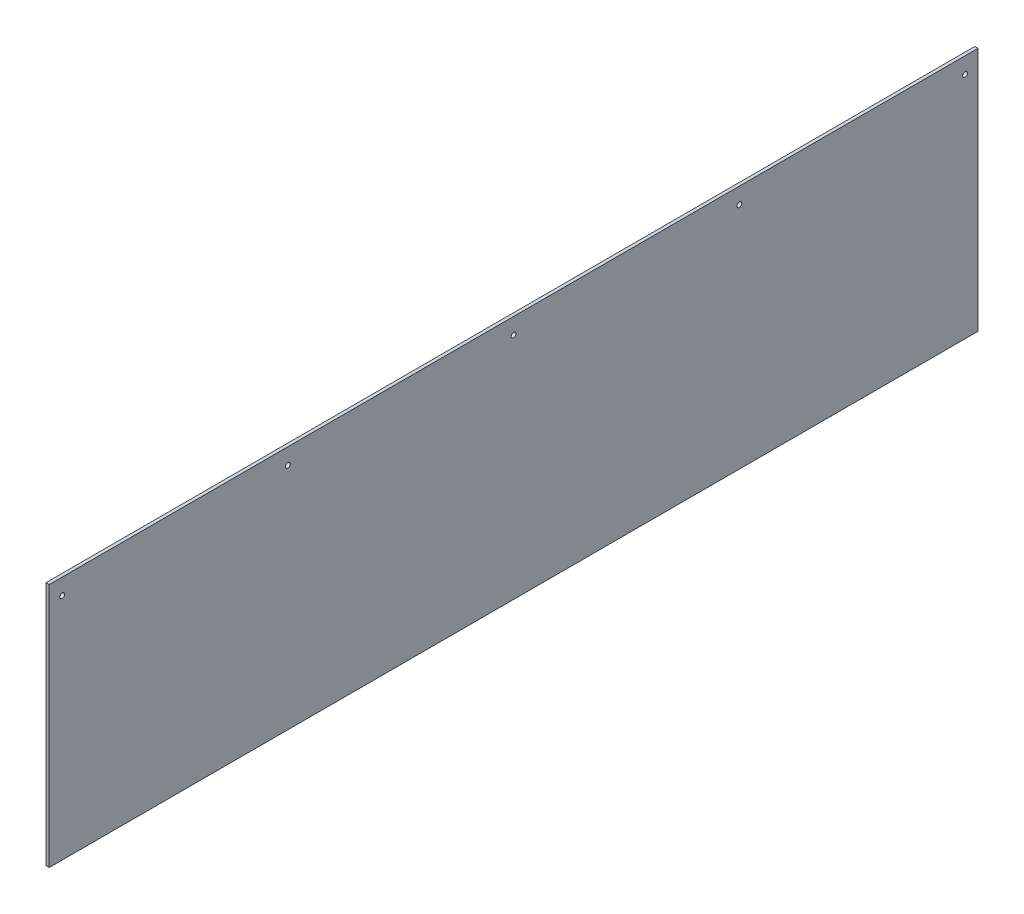
ISO-10303-21;
HEADER;
FILE_DESCRIPTION(('STEP AP214'),'2;1');
FILE_NAME('part.step','',(''),(''),'','','');
FILE_SCHEMA(('AUTOMOTIVE_DESIGN { 1 0 10303 214 1 1 1 1 }'));
ENDSEC;
DATA;
#1=APPLICATION_CONTEXT('core data for automotive mechanical design processes');
#2=APPLICATION_PROTOCOL_DEFINITION('international standard','automotive_design',2000,#1);
#3=PRODUCT_CONTEXT('',#1,'mechanical');
#4=PRODUCT('Part','Part','',(#3));
#5=PRODUCT_RELATED_PRODUCT_CATEGORY('part','',(#4));
#6=PRODUCT_DEFINITION_FORMATION('','',#4);
#7=PRODUCT_DEFINITION_CONTEXT('part definition',#1,'design');
#8=PRODUCT_DEFINITION('design','',#6,#7);
#9=PRODUCT_DEFINITION_SHAPE('','',#8);
#10=(LENGTH_UNIT() NAMED_UNIT(*) SI_UNIT(.MILLI.,.METRE.));
#11=(NAMED_UNIT(*) PLANE_ANGLE_UNIT() SI_UNIT($,.RADIAN.));
#12=(NAMED_UNIT(*) SI_UNIT($,.STERADIAN.) SOLID_ANGLE_UNIT());
#13=UNCERTAINTY_MEASURE_WITH_UNIT(LENGTH_MEASURE(1.E-05),#10,'distance_accuracy_value','');
#14=(GEOMETRIC_REPRESENTATION_CONTEXT(3) GLOBAL_UNCERTAINTY_ASSIGNED_CONTEXT((#13)) GLOBAL_UNIT_ASSIGNED_CONTEXT((#10,
#11,#12)) REPRESENTATION_CONTEXT('',''));
#15=CARTESIAN_POINT('',(0.,0.,0.));
#16=DIRECTION('',(0.,0.,1.));
#17=DIRECTION('',(1.,0.,0.));
#18=AXIS2_PLACEMENT_3D('',#15,#16,#17);
#19=CARTESIAN_POINT('',(6.35,0.,0.));
#20=DIRECTION('',(1.,0.,0.));
#21=DIRECTION('',(0.,0.,-1.));
#22=AXIS2_PLACEMENT_3D('',#19,#20,#21);
#23=PLANE('',#22);
#24=CARTESIAN_POINT('',(6.35,450.85,-1803.4));
#25=DIRECTION('',(1.,0.,0.));
#26=DIRECTION('',(0.,0.,-1.));
#27=AXIS2_PLACEMENT_3D('',#24,#25,#26);
#28=CIRCLE('',#27,4.7625);
#29=CARTESIAN_POINT('',(6.35,450.85,-1808.1625));
#30=VERTEX_POINT('',#29);
#31=EDGE_CURVE('E95',#30,#30,#28,.F.);
#32=ORIENTED_EDGE('',*,*,#31,.T.);
#33=EDGE_LOOP('',(#32));
#34=FACE_BOUND('',#33,.T.);
#35=CARTESIAN_POINT('',(6.35,450.85,-1358.9));
#36=DIRECTION('',(1.,0.,0.));
#37=DIRECTION('',(0.,0.,-1.));
#38=AXIS2_PLACEMENT_3D('',#35,#36,#37);
#39=CIRCLE('',#38,4.7625);
#40=CARTESIAN_POINT('',(6.35,450.85,-1363.6625));
#41=VERTEX_POINT('',#40);
#42=EDGE_CURVE('E98',#41,#41,#39,.F.);
#43=ORIENTED_EDGE('',*,*,#42,.T.);
#44=EDGE_LOOP('',(#43));
#45=FACE_BOUND('',#44,.T.);
#46=CARTESIAN_POINT('',(6.35,450.85,-914.4));
#47=DIRECTION('',(1.,0.,0.));
#48=DIRECTION('',(0.,0.,-1.));
#49=AXIS2_PLACEMENT_3D('',#46,#47,#48);
#50=CIRCLE('',#49,4.7625);
#51=CARTESIAN_POINT('',(6.35,450.85,-919.1625));
#52=VERTEX_POINT('',#51);
#53=EDGE_CURVE('E101',#52,#52,#50,.F.);
#54=ORIENTED_EDGE('',*,*,#53,.T.);
#55=EDGE_LOOP('',(#54));
#56=FACE_BOUND('',#55,.T.);
#57=CARTESIAN_POINT('',(6.35,450.85,-469.9));
#58=DIRECTION('',(1.,0.,0.));
#59=DIRECTION('',(0.,0.,-1.));
#60=AXIS2_PLACEMENT_3D('',#57,#58,#59);
#61=CIRCLE('',#60,4.7625);
#62=CARTESIAN_POINT('',(6.35,450.85,-474.6625));
#63=VERTEX_POINT('',#62);
#64=EDGE_CURVE('E103',#63,#63,#61,.F.);
#65=ORIENTED_EDGE('',*,*,#64,.T.);
#66=EDGE_LOOP('',(#65));
#67=FACE_BOUND('',#66,.T.);
#68=CARTESIAN_POINT('',(6.35,450.85,-25.4));
#69=DIRECTION('',(1.,0.,0.));
#70=DIRECTION('',(0.,0.,-1.));
#71=AXIS2_PLACEMENT_3D('',#68,#69,#70);
#72=CIRCLE('',#71,4.7625);
#73=CARTESIAN_POINT('',(6.35,450.85,-30.1625));
#74=VERTEX_POINT('',#73);
#75=EDGE_CURVE('E20',#74,#74,#72,.F.);
#76=ORIENTED_EDGE('',*,*,#75,.T.);
#77=EDGE_LOOP('',(#76));
#78=FACE_BOUND('',#77,.T.);
#79=DIRECTION('',(0.,1.,0.));
#80=VECTOR('',#79,1.);
#81=CARTESIAN_POINT('',(6.35,482.6,0.));
#82=LINE('',#81,#80);
#83=CARTESIAN_POINT('',(6.35,0.,0.));
#84=VERTEX_POINT('',#83);
#85=CARTESIAN_POINT('',(6.35,482.6,0.));
#86=VERTEX_POINT('',#85);
#87=EDGE_CURVE('E71',#84,#86,#82,.T.);
#88=ORIENTED_EDGE('',*,*,#87,.F.);
#89=DIRECTION('',(0.,0.,-1.));
#90=VECTOR('',#89,1.);
#91=CARTESIAN_POINT('',(6.35,0.,0.));
#92=LINE('',#91,#90);
#93=CARTESIAN_POINT('',(6.35,0.,-1828.8));
#94=VERTEX_POINT('',#93);
#95=EDGE_CURVE('E68',#94,#84,#92,.F.);
#96=ORIENTED_EDGE('',*,*,#95,.F.);
#97=DIRECTION('',(0.,1.,0.));
#98=VECTOR('',#97,1.);
#99=CARTESIAN_POINT('',(6.35,0.,-1828.8));
#100=LINE('',#99,#98);
#101=CARTESIAN_POINT('',(6.35,482.6,-1828.8));
#102=VERTEX_POINT('',#101);
#103=EDGE_CURVE('E59',#102,#94,#100,.F.);
#104=ORIENTED_EDGE('',*,*,#103,.F.);
#105=DIRECTION('',(0.,0.,1.));
#106=VECTOR('',#105,1.);
#107=CARTESIAN_POINT('',(6.35,482.6,-1828.8));
#108=LINE('',#107,#106);
#109=EDGE_CURVE('E54',#86,#102,#108,.F.);
#110=ORIENTED_EDGE('',*,*,#109,.F.);
#111=EDGE_LOOP('',(#88,#96,#104,#110));
#112=FACE_BOUND('',#111,.T.);
#113=ADVANCED_FACE('F17',(#34,#45,#56,#67,#78,#112),#23,.T.);
#114=CARTESIAN_POINT('',(0.,0.,0.));
#115=DIRECTION('',(0.,-1.,0.));
#116=DIRECTION('',(0.,0.,-1.));
#117=AXIS2_PLACEMENT_3D('',#114,#115,#116);
#118=PLANE('',#117);
#119=DIRECTION('',(1.,0.,0.));
#120=VECTOR('',#119,1.);
#121=CARTESIAN_POINT('',(0.,0.,0.));
#122=LINE('',#121,#120);
#123=CARTESIAN_POINT('',(0.,0.,0.));
#124=VERTEX_POINT('',#123);
#125=EDGE_CURVE('E111',#124,#84,#122,.T.);
#126=ORIENTED_EDGE('',*,*,#125,.F.);
#127=DIRECTION('',(0.,0.,-1.));
#128=VECTOR('',#127,1.);
#129=CARTESIAN_POINT('',(0.,0.,0.));
#130=LINE('',#129,#128);
#131=CARTESIAN_POINT('',(0.,0.,-1828.8));
#132=VERTEX_POINT('',#131);
#133=EDGE_CURVE('E78',#124,#132,#130,.T.);
#134=ORIENTED_EDGE('',*,*,#133,.T.);
#135=DIRECTION('',(-1.,0.,0.));
#136=VECTOR('',#135,1.);
#137=CARTESIAN_POINT('',(0.,0.,-1828.8));
#138=LINE('',#137,#136);
#139=EDGE_CURVE('E64',#94,#132,#138,.T.);
#140=ORIENTED_EDGE('',*,*,#139,.F.);
#141=ORIENTED_EDGE('',*,*,#95,.T.);
#142=EDGE_LOOP('',(#126,#134,#140,#141));
#143=FACE_BOUND('',#142,.T.);
#144=ADVANCED_FACE('F77',(#143),#118,.T.);
#145=CARTESIAN_POINT('',(0.,0.,-1828.8));
#146=DIRECTION('',(0.,0.,-1.));
#147=DIRECTION('',(-1.,0.,0.));
#148=AXIS2_PLACEMENT_3D('',#145,#146,#147);
#149=PLANE('',#148);
#150=ORIENTED_EDGE('',*,*,#139,.T.);
#151=DIRECTION('',(0.,1.,0.));
#152=VECTOR('',#151,1.);
#153=CARTESIAN_POINT('',(0.,0.,-1828.8));
#154=LINE('',#153,#152);
#155=CARTESIAN_POINT('',(0.,482.6,-1828.8));
#156=VERTEX_POINT('',#155);
#157=EDGE_CURVE('E122',#132,#156,#154,.T.);
#158=ORIENTED_EDGE('',*,*,#157,.T.);
#159=DIRECTION('',(1.,0.,0.));
#160=VECTOR('',#159,1.);
#161=CARTESIAN_POINT('',(0.,482.6,-1828.8));
#162=LINE('',#161,#160);
#163=EDGE_CURVE('E66',#102,#156,#162,.F.);
#164=ORIENTED_EDGE('',*,*,#163,.F.);
#165=ORIENTED_EDGE('',*,*,#103,.T.);
#166=EDGE_LOOP('',(#150,#158,#164,#165));
#167=FACE_BOUND('',#166,.T.);
#168=ADVANCED_FACE('F61',(#167),#149,.T.);
#169=CARTESIAN_POINT('',(0.,482.6,-1828.8));
#170=DIRECTION('',(0.,1.,0.));
#171=DIRECTION('',(0.,0.,1.));
#172=AXIS2_PLACEMENT_3D('',#169,#170,#171);
#173=PLANE('',#172);
#174=ORIENTED_EDGE('',*,*,#163,.T.);
#175=DIRECTION('',(0.,0.,-1.));
#176=VECTOR('',#175,1.);
#177=CARTESIAN_POINT('',(0.,482.6,0.));
#178=LINE('',#177,#176);
#179=CARTESIAN_POINT('',(0.,482.6,0.));
#180=VERTEX_POINT('',#179);
#181=EDGE_CURVE('E119',#156,#180,#178,.F.);
#182=ORIENTED_EDGE('',*,*,#181,.T.);
#183=DIRECTION('',(1.,0.,0.));
#184=VECTOR('',#183,1.);
#185=CARTESIAN_POINT('',(0.,482.6,0.));
#186=LINE('',#185,#184);
#187=EDGE_CURVE('E35',#86,#180,#186,.F.);
#188=ORIENTED_EDGE('',*,*,#187,.F.);
#189=ORIENTED_EDGE('',*,*,#109,.T.);
#190=EDGE_LOOP('',(#174,#182,#188,#189));
#191=FACE_BOUND('',#190,.T.);
#192=ADVANCED_FACE('F118',(#191),#173,.T.);
#193=CARTESIAN_POINT('',(0.,482.6,0.));
#194=DIRECTION('',(0.,0.,1.));
#195=DIRECTION('',(1.,0.,0.));
#196=AXIS2_PLACEMENT_3D('',#193,#194,#195);
#197=PLANE('',#196);
#198=ORIENTED_EDGE('',*,*,#187,.T.);
#199=DIRECTION('',(0.,1.,0.));
#200=VECTOR('',#199,1.);
#201=CARTESIAN_POINT('',(0.,0.,0.));
#202=LINE('',#201,#200);
#203=EDGE_CURVE('E94',#180,#124,#202,.F.);
#204=ORIENTED_EDGE('',*,*,#203,.T.);
#205=ORIENTED_EDGE('',*,*,#125,.T.);
#206=ORIENTED_EDGE('',*,*,#87,.T.);
#207=EDGE_LOOP('',(#198,#204,#205,#206));
#208=FACE_BOUND('',#207,.T.);
#209=ADVANCED_FACE('F125',(#208),#197,.T.);
#210=CARTESIAN_POINT('',(6.35,450.85,-25.4));
#211=DIRECTION('',(1.,0.,0.));
#212=DIRECTION('',(0.,0.,-1.));
#213=AXIS2_PLACEMENT_3D('',#210,#211,#212);
#214=CYLINDRICAL_SURFACE('',#213,4.7625);
#215=ORIENTED_EDGE('',*,*,#75,.F.);
#216=EDGE_LOOP('',(#215));
#217=FACE_BOUND('',#216,.T.);
#218=CARTESIAN_POINT('',(0.,450.85,-25.4));
#219=DIRECTION('',(1.,0.,0.));
#220=DIRECTION('',(0.,0.,-1.));
#221=AXIS2_PLACEMENT_3D('',#218,#219,#220);
#222=CIRCLE('',#221,4.7625);
#223=CARTESIAN_POINT('',(0.,450.85,-30.1625));
#224=VERTEX_POINT('',#223);
#225=EDGE_CURVE('E91',#224,#224,#222,.F.);
#226=ORIENTED_EDGE('',*,*,#225,.T.);
#227=EDGE_LOOP('',(#226));
#228=FACE_BOUND('',#227,.T.);
#229=ADVANCED_FACE('F127',(#217,#228),#214,.F.);
#230=CARTESIAN_POINT('',(6.35,450.85,-469.9));
#231=DIRECTION('',(1.,0.,0.));
#232=DIRECTION('',(0.,0.,-1.));
#233=AXIS2_PLACEMENT_3D('',#230,#231,#232);
#234=CYLINDRICAL_SURFACE('',#233,4.7625);
#235=ORIENTED_EDGE('',*,*,#64,.F.);
#236=EDGE_LOOP('',(#235));
#237=FACE_BOUND('',#236,.T.);
#238=CARTESIAN_POINT('',(0.,450.85,-469.9));
#239=DIRECTION('',(1.,0.,0.));
#240=DIRECTION('',(0.,0.,-1.));
#241=AXIS2_PLACEMENT_3D('',#238,#239,#240);
#242=CIRCLE('',#241,4.7625);
#243=CARTESIAN_POINT('',(0.,450.85,-474.6625));
#244=VERTEX_POINT('',#243);
#245=EDGE_CURVE('E88',#244,#244,#242,.F.);
#246=ORIENTED_EDGE('',*,*,#245,.T.);
#247=EDGE_LOOP('',(#246));
#248=FACE_BOUND('',#247,.T.);
#249=ADVANCED_FACE('F134',(#237,#248),#234,.F.);
#250=CARTESIAN_POINT('',(6.35,450.85,-914.4));
#251=DIRECTION('',(1.,0.,0.));
#252=DIRECTION('',(0.,0.,-1.));
#253=AXIS2_PLACEMENT_3D('',#250,#251,#252);
#254=CYLINDRICAL_SURFACE('',#253,4.7625);
#255=ORIENTED_EDGE('',*,*,#53,.F.);
#256=EDGE_LOOP('',(#255));
#257=FACE_BOUND('',#256,.T.);
#258=CARTESIAN_POINT('',(0.,450.85,-914.4));
#259=DIRECTION('',(1.,0.,0.));
#260=DIRECTION('',(0.,0.,-1.));
#261=AXIS2_PLACEMENT_3D('',#258,#259,#260);
#262=CIRCLE('',#261,4.7625);
#263=CARTESIAN_POINT('',(0.,450.85,-919.1625));
#264=VERTEX_POINT('',#263);
#265=EDGE_CURVE('E85',#264,#264,#262,.F.);
#266=ORIENTED_EDGE('',*,*,#265,.T.);
#267=EDGE_LOOP('',(#266));
#268=FACE_BOUND('',#267,.T.);
#269=ADVANCED_FACE('F153',(#257,#268),#254,.F.);
#270=CARTESIAN_POINT('',(6.35,450.85,-1358.9));
#271=DIRECTION('',(1.,0.,0.));
#272=DIRECTION('',(0.,0.,-1.));
#273=AXIS2_PLACEMENT_3D('',#270,#271,#272);
#274=CYLINDRICAL_SURFACE('',#273,4.7625);
#275=ORIENTED_EDGE('',*,*,#42,.F.);
#276=EDGE_LOOP('',(#275));
#277=FACE_BOUND('',#276,.T.);
#278=CARTESIAN_POINT('',(0.,450.85,-1358.9));
#279=DIRECTION('',(1.,0.,0.));
#280=DIRECTION('',(0.,0.,-1.));
#281=AXIS2_PLACEMENT_3D('',#278,#279,#280);
#282=CIRCLE('',#281,4.7625);
#283=CARTESIAN_POINT('',(0.,450.85,-1363.6625));
#284=VERTEX_POINT('',#283);
#285=EDGE_CURVE('E26',#284,#284,#282,.F.);
#286=ORIENTED_EDGE('',*,*,#285,.T.);
#287=EDGE_LOOP('',(#286));
#288=FACE_BOUND('',#287,.T.);
#289=ADVANCED_FACE('F145',(#277,#288),#274,.F.);
#290=CARTESIAN_POINT('',(6.35,450.85,-1803.4));
#291=DIRECTION('',(1.,0.,0.));
#292=DIRECTION('',(0.,0.,-1.));
#293=AXIS2_PLACEMENT_3D('',#290,#291,#292);
#294=CYLINDRICAL_SURFACE('',#293,4.7625);
#295=ORIENTED_EDGE('',*,*,#31,.F.);
#296=EDGE_LOOP('',(#295));
#297=FACE_BOUND('',#296,.T.);
#298=CARTESIAN_POINT('',(0.,450.85,-1803.4));
#299=DIRECTION('',(1.,0.,0.));
#300=DIRECTION('',(0.,0.,-1.));
#301=AXIS2_PLACEMENT_3D('',#298,#299,#300);
#302=CIRCLE('',#301,4.7625);
#303=CARTESIAN_POINT('',(0.,450.85,-1808.1625));
#304=VERTEX_POINT('',#303);
#305=EDGE_CURVE('E11',#304,#304,#302,.F.);
#306=ORIENTED_EDGE('',*,*,#305,.T.);
#307=EDGE_LOOP('',(#306));
#308=FACE_BOUND('',#307,.T.);
#309=ADVANCED_FACE('F139',(#297,#308),#294,.F.);
#310=CARTESIAN_POINT('',(0.,0.,0.));
#311=DIRECTION('',(1.,0.,0.));
#312=DIRECTION('',(0.,0.,-1.));
#313=AXIS2_PLACEMENT_3D('',#310,#311,#312);
#314=PLANE('',#313);
#315=ORIENTED_EDGE('',*,*,#305,.F.);
#316=EDGE_LOOP('',(#315));
#317=FACE_BOUND('',#316,.T.);
#318=ORIENTED_EDGE('',*,*,#285,.F.);
#319=EDGE_LOOP('',(#318));
#320=FACE_BOUND('',#319,.T.);
#321=ORIENTED_EDGE('',*,*,#265,.F.);
#322=EDGE_LOOP('',(#321));
#323=FACE_BOUND('',#322,.T.);
#324=ORIENTED_EDGE('',*,*,#245,.F.);
#325=EDGE_LOOP('',(#324));
#326=FACE_BOUND('',#325,.T.);
#327=ORIENTED_EDGE('',*,*,#225,.F.);
#328=EDGE_LOOP('',(#327));
#329=FACE_BOUND('',#328,.T.);
#330=ORIENTED_EDGE('',*,*,#181,.F.);
#331=ORIENTED_EDGE('',*,*,#157,.F.);
#332=ORIENTED_EDGE('',*,*,#133,.F.);
#333=ORIENTED_EDGE('',*,*,#203,.F.);
#334=EDGE_LOOP('',(#330,#331,#332,#333));
#335=FACE_BOUND('',#334,.T.);
#336=ADVANCED_FACE('F121',(#317,#320,#323,#326,#329,#335),#314,.F.);
#337=CLOSED_SHELL('',(#113,#144,#168,#192,#209,#229,#249,#269,#289,#309,#336));
#338=MANIFOLD_SOLID_BREP('B1',#337);
#339=ADVANCED_BREP_SHAPE_REPRESENTATION('',(#18,#338),#14);
#340=SHAPE_DEFINITION_REPRESENTATION(#9,#339);
ENDSEC;
END-ISO-10303-21;
